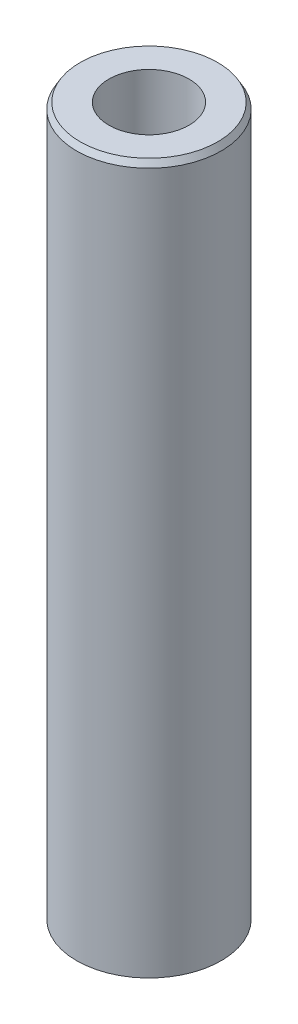
ISO-10303-21;
HEADER;
FILE_DESCRIPTION(('STEP AP214'),'2;1');
FILE_NAME('part.step','',(''),(''),'','','');
FILE_SCHEMA(('AUTOMOTIVE_DESIGN { 1 0 10303 214 1 1 1 1 }'));
ENDSEC;
DATA;
#1=APPLICATION_CONTEXT('core data for automotive mechanical design processes');
#2=APPLICATION_PROTOCOL_DEFINITION('international standard','automotive_design',2000,#1);
#3=PRODUCT_CONTEXT('',#1,'mechanical');
#4=PRODUCT('Part','Part','',(#3));
#5=PRODUCT_RELATED_PRODUCT_CATEGORY('part','',(#4));
#6=PRODUCT_DEFINITION_FORMATION('','',#4);
#7=PRODUCT_DEFINITION_CONTEXT('part definition',#1,'design');
#8=PRODUCT_DEFINITION('design','',#6,#7);
#9=PRODUCT_DEFINITION_SHAPE('','',#8);
#10=(LENGTH_UNIT() NAMED_UNIT(*) SI_UNIT(.MILLI.,.METRE.));
#11=(NAMED_UNIT(*) PLANE_ANGLE_UNIT() SI_UNIT($,.RADIAN.));
#12=(NAMED_UNIT(*) SI_UNIT($,.STERADIAN.) SOLID_ANGLE_UNIT());
#13=UNCERTAINTY_MEASURE_WITH_UNIT(LENGTH_MEASURE(1.E-05),#10,'distance_accuracy_value','');
#14=(GEOMETRIC_REPRESENTATION_CONTEXT(3) GLOBAL_UNCERTAINTY_ASSIGNED_CONTEXT((#13)) GLOBAL_UNIT_ASSIGNED_CONTEXT((#10,
#11,#12)) REPRESENTATION_CONTEXT('',''));
#15=CARTESIAN_POINT('',(0.,0.,0.));
#16=DIRECTION('',(0.,0.,1.));
#17=DIRECTION('',(1.,0.,0.));
#18=AXIS2_PLACEMENT_3D('',#15,#16,#17);
#19=CARTESIAN_POINT('',(0.,147.478424562871,0.));
#20=DIRECTION('',(0.,-1.,0.));
#21=DIRECTION('',(0.,0.,-1.));
#22=AXIS2_PLACEMENT_3D('',#19,#20,#21);
#23=CYLINDRICAL_SURFACE('',#22,15.);
#24=CARTESIAN_POINT('',(0.,146.202891820584,0.));
#25=DIRECTION('',(0.,1.,0.));
#26=DIRECTION('',(0.,0.,1.));
#27=AXIS2_PLACEMENT_3D('',#24,#25,#26);
#28=CIRCLE('',#27,15.);
#29=CARTESIAN_POINT('',(0.,146.202891820584,15.));
#30=VERTEX_POINT('',#29);
#31=EDGE_CURVE('E50',#30,#30,#28,.F.);
#32=ORIENTED_EDGE('',*,*,#31,.T.);
#33=EDGE_LOOP('',(#32));
#34=FACE_BOUND('',#33,.T.);
#35=CARTESIAN_POINT('',(0.,0.736429172119885,0.));
#36=DIRECTION('',(0.,1.,0.));
#37=DIRECTION('',(0.,0.,1.));
#38=AXIS2_PLACEMENT_3D('',#35,#36,#37);
#39=CIRCLE('',#38,15.);
#40=CARTESIAN_POINT('',(0.,0.736429172119885,15.));
#41=VERTEX_POINT('',#40);
#42=EDGE_CURVE('E51',#41,#41,#39,.T.);
#43=ORIENTED_EDGE('',*,*,#42,.T.);
#44=EDGE_LOOP('',(#43));
#45=FACE_BOUND('',#44,.T.);
#46=ADVANCED_FACE('F39',(#34,#45),#23,.T.);
#47=CARTESIAN_POINT('',(0.,147.478424562871,0.));
#48=DIRECTION('',(0.,1.,0.));
#49=DIRECTION('',(0.,0.,1.));
#50=AXIS2_PLACEMENT_3D('',#47,#48,#49);
#51=PLANE('',#50);
#52=CARTESIAN_POINT('',(0.,147.478424562871,0.));
#53=DIRECTION('',(0.,1.,0.));
#54=DIRECTION('',(0.,0.,1.));
#55=AXIS2_PLACEMENT_3D('',#52,#53,#54);
#56=CIRCLE('',#55,14.2635708278802);
#57=CARTESIAN_POINT('',(0.,147.478424562871,14.2635708278802));
#58=VERTEX_POINT('',#57);
#59=EDGE_CURVE('E54',#58,#58,#56,.T.);
#60=ORIENTED_EDGE('',*,*,#59,.T.);
#61=EDGE_LOOP('',(#60));
#62=FACE_BOUND('',#61,.T.);
#63=CARTESIAN_POINT('',(0.,147.478424562871,0.));
#64=DIRECTION('',(0.,1.,0.));
#65=DIRECTION('',(0.,0.,1.));
#66=AXIS2_PLACEMENT_3D('',#63,#64,#65);
#67=CIRCLE('',#66,8.31130566165986);
#68=CARTESIAN_POINT('',(0.,147.478424562871,8.31130566165986));
#69=VERTEX_POINT('',#68);
#70=EDGE_CURVE('E58',#69,#69,#67,.T.);
#71=ORIENTED_EDGE('',*,*,#70,.F.);
#72=EDGE_LOOP('',(#71));
#73=FACE_BOUND('',#72,.T.);
#74=ADVANCED_FACE('F69',(#62,#73),#51,.T.);
#75=CARTESIAN_POINT('',(0.,0.,0.));
#76=DIRECTION('',(0.,1.,0.));
#77=DIRECTION('',(0.,0.,1.));
#78=AXIS2_PLACEMENT_3D('',#75,#76,#77);
#79=PLANE('',#78);
#80=CARTESIAN_POINT('',(0.,0.,0.));
#81=DIRECTION('',(0.,1.,0.));
#82=DIRECTION('',(0.,0.,1.));
#83=AXIS2_PLACEMENT_3D('',#80,#81,#82);
#84=CIRCLE('',#83,13.7244672577125);
#85=CARTESIAN_POINT('',(0.,0.,13.7244672577125));
#86=VERTEX_POINT('',#85);
#87=EDGE_CURVE('E10',#86,#86,#84,.F.);
#88=ORIENTED_EDGE('',*,*,#87,.T.);
#89=EDGE_LOOP('',(#88));
#90=FACE_BOUND('',#89,.T.);
#91=CARTESIAN_POINT('',(0.,0.,0.));
#92=DIRECTION('',(0.,1.,0.));
#93=DIRECTION('',(0.,0.,1.));
#94=AXIS2_PLACEMENT_3D('',#91,#92,#93);
#95=CIRCLE('',#94,8.31130566165986);
#96=CARTESIAN_POINT('',(0.,0.,8.31130566165986));
#97=VERTEX_POINT('',#96);
#98=EDGE_CURVE('E63',#97,#97,#95,.T.);
#99=ORIENTED_EDGE('',*,*,#98,.T.);
#100=EDGE_LOOP('',(#99));
#101=FACE_BOUND('',#100,.T.);
#102=ADVANCED_FACE('F75',(#90,#101),#79,.F.);
#103=CARTESIAN_POINT('',(0.,147.478424562871,0.));
#104=DIRECTION('',(0.,-1.,0.));
#105=DIRECTION('',(0.,0.,-1.));
#106=AXIS2_PLACEMENT_3D('',#103,#104,#105);
#107=CYLINDRICAL_SURFACE('',#106,8.31130566165986);
#108=ORIENTED_EDGE('',*,*,#70,.T.);
#109=EDGE_LOOP('',(#108));
#110=FACE_BOUND('',#109,.T.);
#111=ORIENTED_EDGE('',*,*,#98,.F.);
#112=EDGE_LOOP('',(#111));
#113=FACE_BOUND('',#112,.T.);
#114=ADVANCED_FACE('F70',(#110,#113),#107,.F.);
#115=CARTESIAN_POINT('',(0.,147.478424562871,0.));
#116=DIRECTION('',(0.,-1.,0.));
#117=DIRECTION('',(0.,0.,-1.));
#118=AXIS2_PLACEMENT_3D('',#115,#116,#117);
#119=CONICAL_SURFACE('',#118,14.2635708278802,0.523598775598292);
#120=ORIENTED_EDGE('',*,*,#31,.F.);
#121=EDGE_LOOP('',(#120));
#122=FACE_BOUND('',#121,.T.);
#123=ORIENTED_EDGE('',*,*,#59,.F.);
#124=EDGE_LOOP('',(#123));
#125=FACE_BOUND('',#124,.T.);
#126=ADVANCED_FACE('F81',(#122,#125),#119,.T.);
#127=CARTESIAN_POINT('',(0.,0.736429172119885,0.));
#128=DIRECTION('',(0.,1.,0.));
#129=DIRECTION('',(0.,0.,1.));
#130=AXIS2_PLACEMENT_3D('',#127,#128,#129);
#131=CONICAL_SURFACE('',#130,15.,1.04719755119659);
#132=ORIENTED_EDGE('',*,*,#87,.F.);
#133=EDGE_LOOP('',(#132));
#134=FACE_BOUND('',#133,.T.);
#135=ORIENTED_EDGE('',*,*,#42,.F.);
#136=EDGE_LOOP('',(#135));
#137=FACE_BOUND('',#136,.T.);
#138=ADVANCED_FACE('F45',(#134,#137),#131,.T.);
#139=CLOSED_SHELL('',(#46,#74,#102,#114,#126,#138));
#140=MANIFOLD_SOLID_BREP('B2',#139);
#141=ADVANCED_BREP_SHAPE_REPRESENTATION('',(#18,#140),#14);
#142=SHAPE_DEFINITION_REPRESENTATION(#9,#141);
ENDSEC;
END-ISO-10303-21;
